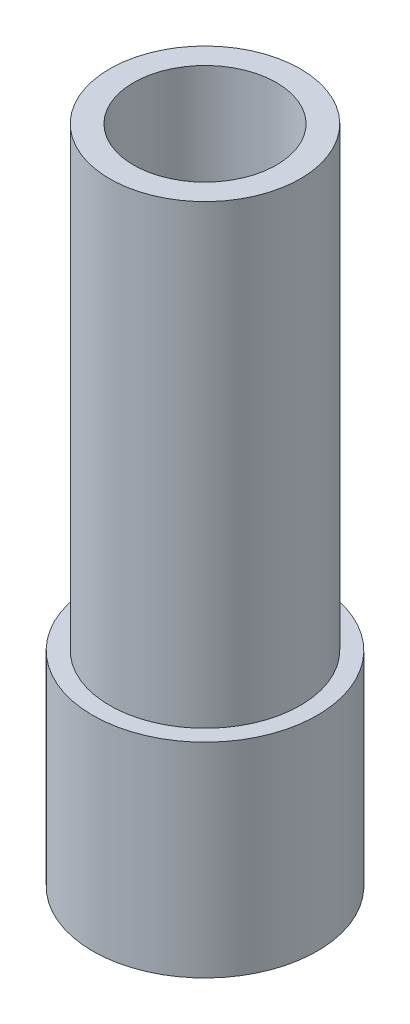
ISO-10303-21;
HEADER;
FILE_DESCRIPTION(('STEP AP214'),'2;1');
FILE_NAME('part.step','',(''),(''),'','','');
FILE_SCHEMA(('AUTOMOTIVE_DESIGN { 1 0 10303 214 1 1 1 1 }'));
ENDSEC;
DATA;
#1=APPLICATION_CONTEXT('core data for automotive mechanical design processes');
#2=APPLICATION_PROTOCOL_DEFINITION('international standard','automotive_design',2000,#1);
#3=PRODUCT_CONTEXT('',#1,'mechanical');
#4=PRODUCT('Part','Part','',(#3));
#5=PRODUCT_RELATED_PRODUCT_CATEGORY('part','',(#4));
#6=PRODUCT_DEFINITION_FORMATION('','',#4);
#7=PRODUCT_DEFINITION_CONTEXT('part definition',#1,'design');
#8=PRODUCT_DEFINITION('design','',#6,#7);
#9=PRODUCT_DEFINITION_SHAPE('','',#8);
#10=(LENGTH_UNIT() NAMED_UNIT(*) SI_UNIT(.MILLI.,.METRE.));
#11=(NAMED_UNIT(*) PLANE_ANGLE_UNIT() SI_UNIT($,.RADIAN.));
#12=(NAMED_UNIT(*) SI_UNIT($,.STERADIAN.) SOLID_ANGLE_UNIT());
#13=UNCERTAINTY_MEASURE_WITH_UNIT(LENGTH_MEASURE(1.E-05),#10,'distance_accuracy_value','');
#14=(GEOMETRIC_REPRESENTATION_CONTEXT(3) GLOBAL_UNCERTAINTY_ASSIGNED_CONTEXT((#13)) GLOBAL_UNIT_ASSIGNED_CONTEXT((#10,
#11,#12)) REPRESENTATION_CONTEXT('',''));
#15=CARTESIAN_POINT('',(0.,0.,0.));
#16=DIRECTION('',(0.,0.,1.));
#17=DIRECTION('',(1.,0.,0.));
#18=AXIS2_PLACEMENT_3D('',#15,#16,#17);
#19=CARTESIAN_POINT('',(4.5,-6.,0.));
#20=DIRECTION('',(0.,-1.,0.));
#21=DIRECTION('',(0.,0.,-1.));
#22=AXIS2_PLACEMENT_3D('',#19,#20,#21);
#23=PLANE('',#22);
#24=CARTESIAN_POINT('',(0.,-6.,0.));
#25=DIRECTION('',(0.,-1.,0.));
#26=DIRECTION('',(0.,0.,-1.));
#27=AXIS2_PLACEMENT_3D('',#24,#25,#26);
#28=CIRCLE('',#27,13.5);
#29=CARTESIAN_POINT('',(0.,-6.,-13.5));
#30=VERTEX_POINT('',#29);
#31=EDGE_CURVE('E10',#30,#30,#28,.T.);
#32=ORIENTED_EDGE('',*,*,#31,.T.);
#33=EDGE_LOOP('',(#32));
#34=FACE_BOUND('',#33,.T.);
#35=CARTESIAN_POINT('',(0.,-6.,0.));
#36=DIRECTION('',(0.,-1.,0.));
#37=DIRECTION('',(0.,0.,-1.));
#38=AXIS2_PLACEMENT_3D('',#35,#36,#37);
#39=CIRCLE('',#38,4.5);
#40=CARTESIAN_POINT('',(0.,-6.,-4.5));
#41=VERTEX_POINT('',#40);
#42=EDGE_CURVE('E65',#41,#41,#39,.T.);
#43=ORIENTED_EDGE('',*,*,#42,.F.);
#44=EDGE_LOOP('',(#43));
#45=FACE_BOUND('',#44,.T.);
#46=ADVANCED_FACE('F31',(#34,#45),#23,.T.);
#47=CARTESIAN_POINT('',(0.,0.,0.));
#48=DIRECTION('',(0.,-1.,0.));
#49=DIRECTION('',(0.,0.,-1.));
#50=AXIS2_PLACEMENT_3D('',#47,#48,#49);
#51=CYLINDRICAL_SURFACE('',#50,13.5);
#52=CARTESIAN_POINT('',(0.,-11.,0.));
#53=DIRECTION('',(0.,-1.,0.));
#54=DIRECTION('',(0.,0.,-1.));
#55=AXIS2_PLACEMENT_3D('',#52,#53,#54);
#56=CIRCLE('',#55,13.5);
#57=CARTESIAN_POINT('',(0.,-11.,-13.5));
#58=VERTEX_POINT('',#57);
#59=EDGE_CURVE('E37',#58,#58,#56,.T.);
#60=ORIENTED_EDGE('',*,*,#59,.T.);
#61=EDGE_LOOP('',(#60));
#62=FACE_BOUND('',#61,.T.);
#63=ORIENTED_EDGE('',*,*,#31,.F.);
#64=EDGE_LOOP('',(#63));
#65=FACE_BOUND('',#64,.T.);
#66=ADVANCED_FACE('F73',(#62,#65),#51,.F.);
#67=CARTESIAN_POINT('',(16.5,-11.,0.));
#68=DIRECTION('',(0.,-1.,0.));
#69=DIRECTION('',(0.,0.,-1.));
#70=AXIS2_PLACEMENT_3D('',#67,#68,#69);
#71=PLANE('',#70);
#72=CARTESIAN_POINT('',(0.,-11.,0.));
#73=DIRECTION('',(0.,-1.,0.));
#74=DIRECTION('',(0.,0.,-1.));
#75=AXIS2_PLACEMENT_3D('',#72,#73,#74);
#76=CIRCLE('',#75,16.5);
#77=CARTESIAN_POINT('',(0.,-11.,-16.5));
#78=VERTEX_POINT('',#77);
#79=EDGE_CURVE('E41',#78,#78,#76,.T.);
#80=ORIENTED_EDGE('',*,*,#79,.T.);
#81=EDGE_LOOP('',(#80));
#82=FACE_BOUND('',#81,.T.);
#83=ORIENTED_EDGE('',*,*,#59,.F.);
#84=EDGE_LOOP('',(#83));
#85=FACE_BOUND('',#84,.T.);
#86=ADVANCED_FACE('F77',(#82,#85),#71,.T.);
#87=CARTESIAN_POINT('',(0.,0.,0.));
#88=DIRECTION('',(0.,-1.,0.));
#89=DIRECTION('',(0.,0.,-1.));
#90=AXIS2_PLACEMENT_3D('',#87,#88,#89);
#91=CYLINDRICAL_SURFACE('',#90,16.5);
#92=CARTESIAN_POINT('',(0.,19.,0.));
#93=DIRECTION('',(0.,-1.,0.));
#94=DIRECTION('',(0.,0.,-1.));
#95=AXIS2_PLACEMENT_3D('',#92,#93,#94);
#96=CIRCLE('',#95,16.5);
#97=CARTESIAN_POINT('',(0.,19.,-16.5));
#98=VERTEX_POINT('',#97);
#99=EDGE_CURVE('E45',#98,#98,#96,.T.);
#100=ORIENTED_EDGE('',*,*,#99,.T.);
#101=EDGE_LOOP('',(#100));
#102=FACE_BOUND('',#101,.T.);
#103=ORIENTED_EDGE('',*,*,#79,.F.);
#104=EDGE_LOOP('',(#103));
#105=FACE_BOUND('',#104,.T.);
#106=ADVANCED_FACE('F81',(#102,#105),#91,.T.);
#107=CARTESIAN_POINT('',(16.5,19.,0.));
#108=DIRECTION('',(0.,1.,0.));
#109=DIRECTION('',(0.,0.,1.));
#110=AXIS2_PLACEMENT_3D('',#107,#108,#109);
#111=PLANE('',#110);
#112=CARTESIAN_POINT('',(0.,19.,0.));
#113=DIRECTION('',(0.,-1.,0.));
#114=DIRECTION('',(0.,0.,-1.));
#115=AXIS2_PLACEMENT_3D('',#112,#113,#114);
#116=CIRCLE('',#115,14.);
#117=CARTESIAN_POINT('',(0.,19.,-14.));
#118=VERTEX_POINT('',#117);
#119=EDGE_CURVE('E50',#118,#118,#116,.T.);
#120=ORIENTED_EDGE('',*,*,#119,.T.);
#121=EDGE_LOOP('',(#120));
#122=FACE_BOUND('',#121,.T.);
#123=ORIENTED_EDGE('',*,*,#99,.F.);
#124=EDGE_LOOP('',(#123));
#125=FACE_BOUND('',#124,.T.);
#126=ADVANCED_FACE('F88',(#122,#125),#111,.T.);
#127=CARTESIAN_POINT('',(0.,0.,0.));
#128=DIRECTION('',(0.,-1.,0.));
#129=DIRECTION('',(0.,0.,-1.));
#130=AXIS2_PLACEMENT_3D('',#127,#128,#129);
#131=CYLINDRICAL_SURFACE('',#130,14.);
#132=CARTESIAN_POINT('',(0.,86.,0.));
#133=DIRECTION('',(0.,-1.,0.));
#134=DIRECTION('',(0.,0.,-1.));
#135=AXIS2_PLACEMENT_3D('',#132,#133,#134);
#136=CIRCLE('',#135,14.);
#137=CARTESIAN_POINT('',(0.,86.,-14.));
#138=VERTEX_POINT('',#137);
#139=EDGE_CURVE('E53',#138,#138,#136,.T.);
#140=ORIENTED_EDGE('',*,*,#139,.T.);
#141=EDGE_LOOP('',(#140));
#142=FACE_BOUND('',#141,.T.);
#143=ORIENTED_EDGE('',*,*,#119,.F.);
#144=EDGE_LOOP('',(#143));
#145=FACE_BOUND('',#144,.T.);
#146=ADVANCED_FACE('F92',(#142,#145),#131,.T.);
#147=CARTESIAN_POINT('',(10.5,86.,0.));
#148=DIRECTION('',(0.,1.,0.));
#149=DIRECTION('',(0.,0.,1.));
#150=AXIS2_PLACEMENT_3D('',#147,#148,#149);
#151=PLANE('',#150);
#152=CARTESIAN_POINT('',(0.,86.,0.));
#153=DIRECTION('',(0.,-1.,0.));
#154=DIRECTION('',(0.,0.,-1.));
#155=AXIS2_PLACEMENT_3D('',#152,#153,#154);
#156=CIRCLE('',#155,10.5);
#157=CARTESIAN_POINT('',(0.,86.,-10.5));
#158=VERTEX_POINT('',#157);
#159=EDGE_CURVE('E56',#158,#158,#156,.T.);
#160=ORIENTED_EDGE('',*,*,#159,.T.);
#161=EDGE_LOOP('',(#160));
#162=FACE_BOUND('',#161,.T.);
#163=ORIENTED_EDGE('',*,*,#139,.F.);
#164=EDGE_LOOP('',(#163));
#165=FACE_BOUND('',#164,.T.);
#166=ADVANCED_FACE('F96',(#162,#165),#151,.T.);
#167=CARTESIAN_POINT('',(0.,0.,0.));
#168=DIRECTION('',(0.,-1.,0.));
#169=DIRECTION('',(0.,0.,-1.));
#170=AXIS2_PLACEMENT_3D('',#167,#168,#169);
#171=CYLINDRICAL_SURFACE('',#170,10.5);
#172=CARTESIAN_POINT('',(0.,0.,0.));
#173=DIRECTION('',(0.,-1.,0.));
#174=DIRECTION('',(0.,0.,-1.));
#175=AXIS2_PLACEMENT_3D('',#172,#173,#174);
#176=CIRCLE('',#175,10.5);
#177=CARTESIAN_POINT('',(0.,0.,-10.5));
#178=VERTEX_POINT('',#177);
#179=EDGE_CURVE('E59',#178,#178,#176,.T.);
#180=ORIENTED_EDGE('',*,*,#179,.T.);
#181=EDGE_LOOP('',(#180));
#182=FACE_BOUND('',#181,.T.);
#183=ORIENTED_EDGE('',*,*,#159,.F.);
#184=EDGE_LOOP('',(#183));
#185=FACE_BOUND('',#184,.T.);
#186=ADVANCED_FACE('F100',(#182,#185),#171,.F.);
#187=CARTESIAN_POINT('',(10.5,0.,0.));
#188=DIRECTION('',(0.,1.,0.));
#189=DIRECTION('',(0.,0.,1.));
#190=AXIS2_PLACEMENT_3D('',#187,#188,#189);
#191=PLANE('',#190);
#192=CARTESIAN_POINT('',(0.,0.,0.));
#193=DIRECTION('',(0.,-1.,0.));
#194=DIRECTION('',(0.,0.,-1.));
#195=AXIS2_PLACEMENT_3D('',#192,#193,#194);
#196=CIRCLE('',#195,4.5);
#197=CARTESIAN_POINT('',(0.,0.,-4.5));
#198=VERTEX_POINT('',#197);
#199=EDGE_CURVE('E62',#198,#198,#196,.T.);
#200=ORIENTED_EDGE('',*,*,#199,.T.);
#201=EDGE_LOOP('',(#200));
#202=FACE_BOUND('',#201,.T.);
#203=ORIENTED_EDGE('',*,*,#179,.F.);
#204=EDGE_LOOP('',(#203));
#205=FACE_BOUND('',#204,.T.);
#206=ADVANCED_FACE('F104',(#202,#205),#191,.T.);
#207=CARTESIAN_POINT('',(0.,0.,0.));
#208=DIRECTION('',(0.,-1.,0.));
#209=DIRECTION('',(0.,0.,-1.));
#210=AXIS2_PLACEMENT_3D('',#207,#208,#209);
#211=CYLINDRICAL_SURFACE('',#210,4.5);
#212=ORIENTED_EDGE('',*,*,#42,.T.);
#213=EDGE_LOOP('',(#212));
#214=FACE_BOUND('',#213,.T.);
#215=ORIENTED_EDGE('',*,*,#199,.F.);
#216=EDGE_LOOP('',(#215));
#217=FACE_BOUND('',#216,.T.);
#218=ADVANCED_FACE('F69',(#214,#217),#211,.F.);
#219=CLOSED_SHELL('',(#46,#66,#86,#106,#126,#146,#166,#186,#206,#218));
#220=MANIFOLD_SOLID_BREP('B2',#219);
#221=ADVANCED_BREP_SHAPE_REPRESENTATION('',(#18,#220),#14);
#222=SHAPE_DEFINITION_REPRESENTATION(#9,#221);
ENDSEC;
END-ISO-10303-21;
